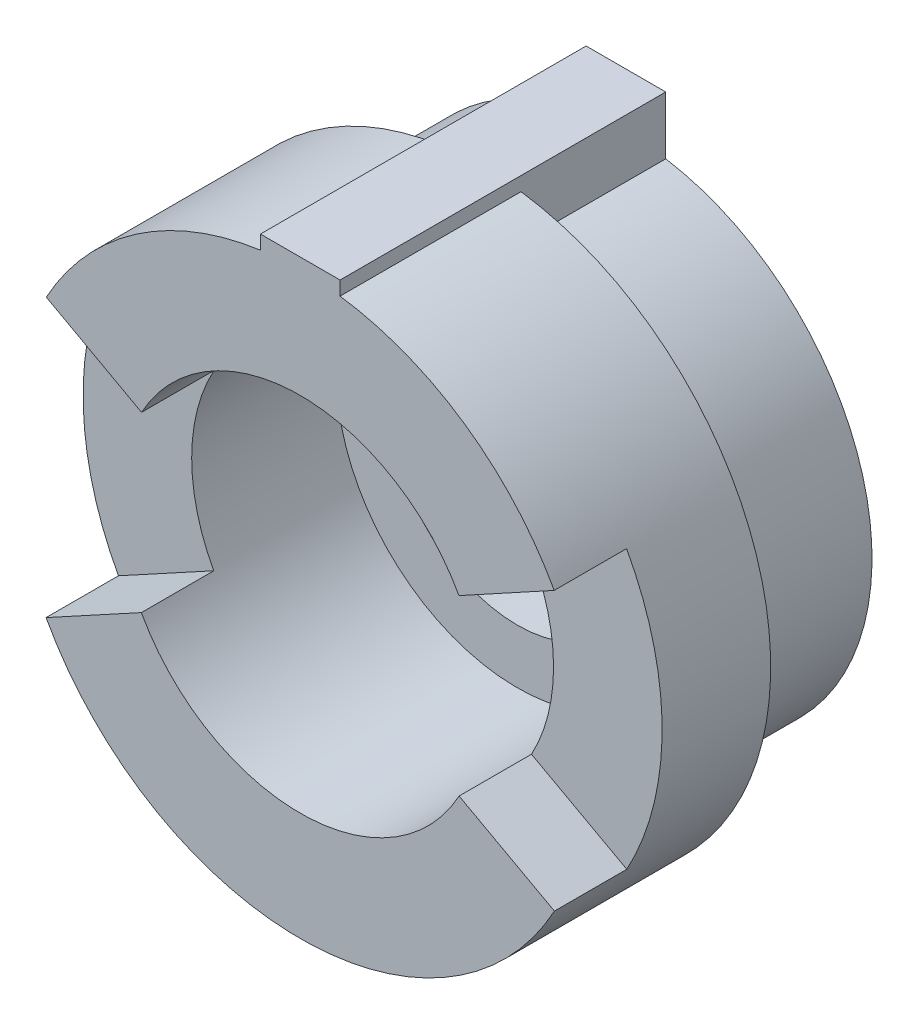
ISO-10303-21;
HEADER;
FILE_DESCRIPTION(('STEP AP214'),'2;1');
FILE_NAME('part.step','',(''),(''),'','','');
FILE_SCHEMA(('AUTOMOTIVE_DESIGN { 1 0 10303 214 1 1 1 1 }'));
ENDSEC;
DATA;
#1=APPLICATION_CONTEXT('core data for automotive mechanical design processes');
#2=APPLICATION_PROTOCOL_DEFINITION('international standard','automotive_design',2000,#1);
#3=PRODUCT_CONTEXT('',#1,'mechanical');
#4=PRODUCT('Part','Part','',(#3));
#5=PRODUCT_RELATED_PRODUCT_CATEGORY('part','',(#4));
#6=PRODUCT_DEFINITION_FORMATION('','',#4);
#7=PRODUCT_DEFINITION_CONTEXT('part definition',#1,'design');
#8=PRODUCT_DEFINITION('design','',#6,#7);
#9=PRODUCT_DEFINITION_SHAPE('','',#8);
#10=(LENGTH_UNIT() NAMED_UNIT(*) SI_UNIT(.MILLI.,.METRE.));
#11=(NAMED_UNIT(*) PLANE_ANGLE_UNIT() SI_UNIT($,.RADIAN.));
#12=(NAMED_UNIT(*) SI_UNIT($,.STERADIAN.) SOLID_ANGLE_UNIT());
#13=UNCERTAINTY_MEASURE_WITH_UNIT(LENGTH_MEASURE(1.E-05),#10,'distance_accuracy_value','');
#14=(GEOMETRIC_REPRESENTATION_CONTEXT(3) GLOBAL_UNCERTAINTY_ASSIGNED_CONTEXT((#13)) GLOBAL_UNIT_ASSIGNED_CONTEXT((#10,
#11,#12)) REPRESENTATION_CONTEXT('',''));
#15=CARTESIAN_POINT('',(0.,0.,0.));
#16=DIRECTION('',(0.,0.,1.));
#17=DIRECTION('',(1.,0.,0.));
#18=AXIS2_PLACEMENT_3D('',#15,#16,#17);
#19=CARTESIAN_POINT('',(0.,0.,9.));
#20=DIRECTION('',(0.,0.,1.));
#21=DIRECTION('',(1.,0.,0.));
#22=AXIS2_PLACEMENT_3D('',#19,#20,#21);
#23=PLANE('',#22);
#24=DIRECTION('',(0.,1.,0.));
#25=VECTOR('',#24,1.);
#26=CARTESIAN_POINT('',(-1.10000000000002,8.31043962792305,9.));
#27=LINE('',#26,#25);
#28=CARTESIAN_POINT('',(-1.10000000000002,7.92401413426301,9.));
#29=VERTEX_POINT('',#28);
#30=CARTESIAN_POINT('',(-1.10000000000002,8.31043962792305,9.));
#31=VERTEX_POINT('',#30);
#32=EDGE_CURVE('E181',#29,#31,#27,.T.);
#33=ORIENTED_EDGE('',*,*,#32,.F.);
#34=CARTESIAN_POINT('',(0.,0.,9.));
#35=DIRECTION('',(0.,0.,1.));
#36=DIRECTION('',(1.,0.,0.));
#37=AXIS2_PLACEMENT_3D('',#34,#35,#36);
#38=CIRCLE('',#37,8.);
#39=CARTESIAN_POINT('',(-7.01760403419745,3.84099383222828,9.));
#40=VERTEX_POINT('',#39);
#41=EDGE_CURVE('E84',#29,#40,#38,.T.);
#42=ORIENTED_EDGE('',*,*,#41,.T.);
#43=DIRECTION('',(-0.877200504274681,0.480124229028535,0.));
#44=VECTOR('',#43,1.);
#45=CARTESIAN_POINT('',(-7.01760403419745,3.84099383222828,9.));
#46=LINE('',#45,#44);
#47=CARTESIAN_POINT('',(-4.38600252137341,2.40062114514268,9.));
#48=VERTEX_POINT('',#47);
#49=EDGE_CURVE('E234',#48,#40,#46,.T.);
#50=ORIENTED_EDGE('',*,*,#49,.F.);
#51=CARTESIAN_POINT('',(0.,0.,9.));
#52=DIRECTION('',(0.,0.,1.));
#53=DIRECTION('',(1.,0.,0.));
#54=AXIS2_PLACEMENT_3D('',#51,#52,#53);
#55=CIRCLE('',#54,5.);
#56=CARTESIAN_POINT('',(4.38600252137341,2.40062114514267,9.));
#57=VERTEX_POINT('',#56);
#58=EDGE_CURVE('E259',#57,#48,#55,.T.);
#59=ORIENTED_EDGE('',*,*,#58,.F.);
#60=DIRECTION('',(0.877200504274682,0.480124229028534,0.));
#61=VECTOR('',#60,1.);
#62=CARTESIAN_POINT('',(7.01760403419745,3.84099383222827,9.));
#63=LINE('',#62,#61);
#64=CARTESIAN_POINT('',(7.01760403419745,3.84099383222827,9.));
#65=VERTEX_POINT('',#64);
#66=EDGE_CURVE('E255',#57,#65,#63,.T.);
#67=ORIENTED_EDGE('',*,*,#66,.T.);
#68=CARTESIAN_POINT('',(1.09999999999999,7.92401413426301,9.));
#69=VERTEX_POINT('',#68);
#70=EDGE_CURVE('E188',#65,#69,#38,.T.);
#71=ORIENTED_EDGE('',*,*,#70,.T.);
#72=DIRECTION('',(0.,-1.,0.));
#73=VECTOR('',#72,1.);
#74=CARTESIAN_POINT('',(1.09999999999999,7.73115928508523,9.));
#75=LINE('',#74,#73);
#76=CARTESIAN_POINT('',(1.09999999999999,8.31043962792305,9.));
#77=VERTEX_POINT('',#76);
#78=EDGE_CURVE('E173',#77,#69,#75,.T.);
#79=ORIENTED_EDGE('',*,*,#78,.F.);
#80=DIRECTION('',(1.,0.,0.));
#81=VECTOR('',#80,1.);
#82=CARTESIAN_POINT('',(1.09999999999999,8.31043962792305,9.));
#83=LINE('',#82,#81);
#84=EDGE_CURVE('E186',#31,#77,#83,.T.);
#85=ORIENTED_EDGE('',*,*,#84,.F.);
#86=EDGE_LOOP('',(#33,#42,#50,#59,#67,#71,#79,#85));
#87=FACE_BOUND('',#86,.T.);
#88=ADVANCED_FACE('F69',(#87),#23,.T.);
#89=CARTESIAN_POINT('',(0.,0.,3.));
#90=DIRECTION('',(0.,0.,1.));
#91=DIRECTION('',(1.,0.,0.));
#92=AXIS2_PLACEMENT_3D('',#89,#90,#91);
#93=PLANE('',#92);
#94=CARTESIAN_POINT('',(0.,0.,3.));
#95=DIRECTION('',(0.,0.,1.));
#96=DIRECTION('',(1.,0.,0.));
#97=AXIS2_PLACEMENT_3D('',#94,#95,#96);
#98=CIRCLE('',#97,5.);
#99=CARTESIAN_POINT('',(5.,0.,3.));
#100=VERTEX_POINT('',#99);
#101=EDGE_CURVE('E268',#100,#100,#98,.F.);
#102=ORIENTED_EDGE('',*,*,#101,.F.);
#103=EDGE_LOOP('',(#102));
#104=FACE_BOUND('',#103,.T.);
#105=CARTESIAN_POINT('',(0.,0.,3.));
#106=DIRECTION('',(0.,0.,1.));
#107=DIRECTION('',(1.,0.,0.));
#108=AXIS2_PLACEMENT_3D('',#105,#106,#107);
#109=CIRCLE('',#108,3.5);
#110=CARTESIAN_POINT('',(3.5,0.,3.));
#111=VERTEX_POINT('',#110);
#112=EDGE_CURVE('E265',#111,#111,#109,.T.);
#113=ORIENTED_EDGE('',*,*,#112,.F.);
#114=EDGE_LOOP('',(#113));
#115=FACE_BOUND('',#114,.T.);
#116=ADVANCED_FACE('F329',(#104,#115),#93,.T.);
#117=CARTESIAN_POINT('',(0.,0.,0.));
#118=DIRECTION('',(0.,0.,1.));
#119=DIRECTION('',(1.,0.,0.));
#120=AXIS2_PLACEMENT_3D('',#117,#118,#119);
#121=PLANE('',#120);
#122=CARTESIAN_POINT('',(0.,0.,0.));
#123=DIRECTION('',(0.,0.,1.));
#124=DIRECTION('',(-1.,0.,0.));
#125=AXIS2_PLACEMENT_3D('',#122,#123,#124);
#126=CIRCLE('',#125,6.8);
#127=CARTESIAN_POINT('',(-1.1,6.71043962792305,0.));
#128=VERTEX_POINT('',#127);
#129=CARTESIAN_POINT('',(1.09999999999999,6.71043962792305,0.));
#130=VERTEX_POINT('',#129);
#131=EDGE_CURVE('E215',#128,#130,#126,.T.);
#132=ORIENTED_EDGE('',*,*,#131,.F.);
#133=DIRECTION('',(0.,-1.,0.));
#134=VECTOR('',#133,1.);
#135=CARTESIAN_POINT('',(-1.1,7.92401413426301,0.));
#136=LINE('',#135,#134);
#137=CARTESIAN_POINT('',(-1.10000000000002,8.31043962792305,0.));
#138=VERTEX_POINT('',#137);
#139=EDGE_CURVE('E202',#138,#128,#136,.T.);
#140=ORIENTED_EDGE('',*,*,#139,.F.);
#141=DIRECTION('',(1.,0.,0.));
#142=VECTOR('',#141,1.);
#143=CARTESIAN_POINT('',(1.09999999999999,8.31043962792305,0.));
#144=LINE('',#143,#142);
#145=CARTESIAN_POINT('',(1.09999999999999,8.31043962792305,0.));
#146=VERTEX_POINT('',#145);
#147=EDGE_CURVE('E193',#138,#146,#144,.T.);
#148=ORIENTED_EDGE('',*,*,#147,.T.);
#149=DIRECTION('',(0.,1.,0.));
#150=VECTOR('',#149,1.);
#151=CARTESIAN_POINT('',(1.09999999999999,6.71043962792305,0.));
#152=LINE('',#151,#150);
#153=EDGE_CURVE('E175',#130,#146,#152,.T.);
#154=ORIENTED_EDGE('',*,*,#153,.F.);
#155=EDGE_LOOP('',(#132,#140,#148,#154));
#156=FACE_BOUND('',#155,.T.);
#157=CARTESIAN_POINT('',(0.,0.,0.));
#158=DIRECTION('',(0.,0.,1.));
#159=DIRECTION('',(1.,0.,0.));
#160=AXIS2_PLACEMENT_3D('',#157,#158,#159);
#161=CIRCLE('',#160,3.5);
#162=CARTESIAN_POINT('',(3.5,0.,0.));
#163=VERTEX_POINT('',#162);
#164=EDGE_CURVE('E264',#163,#163,#161,.T.);
#165=ORIENTED_EDGE('',*,*,#164,.T.);
#166=EDGE_LOOP('',(#165));
#167=FACE_BOUND('',#166,.T.);
#168=ADVANCED_FACE('F336',(#156,#167),#121,.F.);
#169=CARTESIAN_POINT('',(0.,0.,3.));
#170=DIRECTION('',(0.,0.,-1.));
#171=DIRECTION('',(-1.,0.,0.));
#172=AXIS2_PLACEMENT_3D('',#169,#170,#171);
#173=CYLINDRICAL_SURFACE('',#172,8.);
#174=ORIENTED_EDGE('',*,*,#41,.F.);
#175=DIRECTION('',(0.,0.,-1.));
#176=VECTOR('',#175,1.);
#177=CARTESIAN_POINT('',(-1.10000000000002,7.92401413426301,3.));
#178=LINE('',#177,#176);
#179=CARTESIAN_POINT('',(-1.1,7.92401413426301,4.));
#180=VERTEX_POINT('',#179);
#181=EDGE_CURVE('E200',#29,#180,#178,.T.);
#182=ORIENTED_EDGE('',*,*,#181,.T.);
#183=CARTESIAN_POINT('',(0.,0.,4.));
#184=DIRECTION('',(0.,0.,-1.));
#185=DIRECTION('',(-1.,0.,0.));
#186=AXIS2_PLACEMENT_3D('',#183,#184,#185);
#187=CIRCLE('',#186,8.);
#188=CARTESIAN_POINT('',(1.09999999999999,7.92401413426301,4.));
#189=VERTEX_POINT('',#188);
#190=EDGE_CURVE('E203',#189,#180,#187,.T.);
#191=ORIENTED_EDGE('',*,*,#190,.F.);
#192=DIRECTION('',(0.,0.,-1.));
#193=VECTOR('',#192,1.);
#194=CARTESIAN_POINT('',(1.09999999999999,7.92401413426301,3.));
#195=LINE('',#194,#193);
#196=EDGE_CURVE('E91',#189,#69,#195,.F.);
#197=ORIENTED_EDGE('',*,*,#196,.T.);
#198=ORIENTED_EDGE('',*,*,#70,.F.);
#199=DIRECTION('',(0.,0.,1.));
#200=VECTOR('',#199,1.);
#201=CARTESIAN_POINT('',(7.01760403419745,3.84099383222827,7.));
#202=LINE('',#201,#200);
#203=CARTESIAN_POINT('',(7.01760403419745,3.84099383222827,7.));
#204=VERTEX_POINT('',#203);
#205=EDGE_CURVE('E244',#204,#65,#202,.T.);
#206=ORIENTED_EDGE('',*,*,#205,.F.);
#207=CARTESIAN_POINT('',(0.,0.,7.));
#208=DIRECTION('',(0.,0.,-1.));
#209=DIRECTION('',(0.877964062999077,-0.478726544158722,0.));
#210=AXIS2_PLACEMENT_3D('',#207,#208,#209);
#211=CIRCLE('',#210,8.);
#212=CARTESIAN_POINT('',(7.02371250399262,-3.82981235326977,7.));
#213=VERTEX_POINT('',#212);
#214=EDGE_CURVE('E240',#204,#213,#211,.T.);
#215=ORIENTED_EDGE('',*,*,#214,.T.);
#216=DIRECTION('',(0.,0.,-1.));
#217=VECTOR('',#216,1.);
#218=CARTESIAN_POINT('',(7.02371250399262,-3.82981235326977,9.));
#219=LINE('',#218,#217);
#220=CARTESIAN_POINT('',(7.02371250399262,-3.82981235326977,9.));
#221=VERTEX_POINT('',#220);
#222=EDGE_CURVE('E246',#221,#213,#219,.T.);
#223=ORIENTED_EDGE('',*,*,#222,.F.);
#224=CARTESIAN_POINT('',(-7.02371250399263,-3.82981235326976,9.));
#225=VERTEX_POINT('',#224);
#226=EDGE_CURVE('E262',#225,#221,#38,.T.);
#227=ORIENTED_EDGE('',*,*,#226,.F.);
#228=DIRECTION('',(0.,0.,1.));
#229=VECTOR('',#228,1.);
#230=CARTESIAN_POINT('',(-7.02371250399263,-3.82981235326976,7.));
#231=LINE('',#230,#229);
#232=CARTESIAN_POINT('',(-7.02371250399263,-3.82981235326976,7.));
#233=VERTEX_POINT('',#232);
#234=EDGE_CURVE('E226',#233,#225,#231,.T.);
#235=ORIENTED_EDGE('',*,*,#234,.F.);
#236=CARTESIAN_POINT('',(0.,0.,7.));
#237=DIRECTION('',(0.,0.,-1.));
#238=DIRECTION('',(-0.877200504274681,0.480124229028534,0.));
#239=AXIS2_PLACEMENT_3D('',#236,#237,#238);
#240=CIRCLE('',#239,8.);
#241=CARTESIAN_POINT('',(-7.01760403419745,3.84099383222828,7.));
#242=VERTEX_POINT('',#241);
#243=EDGE_CURVE('E221',#233,#242,#240,.T.);
#244=ORIENTED_EDGE('',*,*,#243,.T.);
#245=DIRECTION('',(0.,0.,-1.));
#246=VECTOR('',#245,1.);
#247=CARTESIAN_POINT('',(-7.01760403419745,3.84099383222828,9.));
#248=LINE('',#247,#246);
#249=EDGE_CURVE('E228',#40,#242,#248,.T.);
#250=ORIENTED_EDGE('',*,*,#249,.F.);
#251=EDGE_LOOP('',(#174,#182,#191,#197,#198,#206,#215,#223,#227,#235,#244,#250));
#252=FACE_BOUND('',#251,.T.);
#253=ADVANCED_FACE('F71',(#252),#173,.T.);
#254=CARTESIAN_POINT('',(0.,0.,3.));
#255=DIRECTION('',(0.,0.,-1.));
#256=DIRECTION('',(-1.,0.,0.));
#257=AXIS2_PLACEMENT_3D('',#254,#255,#256);
#258=CYLINDRICAL_SURFACE('',#257,3.5);
#259=ORIENTED_EDGE('',*,*,#112,.T.);
#260=EDGE_LOOP('',(#259));
#261=FACE_BOUND('',#260,.T.);
#262=ORIENTED_EDGE('',*,*,#164,.F.);
#263=EDGE_LOOP('',(#262));
#264=FACE_BOUND('',#263,.T.);
#265=ADVANCED_FACE('F341',(#261,#264),#258,.F.);
#266=DIRECTION('',(-0.877964062999078,-0.47872654415872,0.));
#267=VECTOR('',#266,1.);
#268=CARTESIAN_POINT('',(-7.02371250399263,-3.82981235326976,9.));
#269=LINE('',#268,#267);
#270=CARTESIAN_POINT('',(-4.38982031499539,-2.3936327207936,9.));
#271=VERTEX_POINT('',#270);
#272=EDGE_CURVE('E237',#271,#225,#269,.T.);
#273=ORIENTED_EDGE('',*,*,#272,.T.);
#274=ORIENTED_EDGE('',*,*,#226,.T.);
#275=DIRECTION('',(0.877964062999077,-0.478726544158722,0.));
#276=VECTOR('',#275,1.);
#277=CARTESIAN_POINT('',(7.02371250399262,-3.82981235326977,9.));
#278=LINE('',#277,#276);
#279=CARTESIAN_POINT('',(4.38982031499539,-2.39363272079361,9.));
#280=VERTEX_POINT('',#279);
#281=EDGE_CURVE('E252',#280,#221,#278,.T.);
#282=ORIENTED_EDGE('',*,*,#281,.F.);
#283=EDGE_CURVE('E257',#271,#280,#55,.T.);
#284=ORIENTED_EDGE('',*,*,#283,.F.);
#285=EDGE_LOOP('',(#273,#274,#282,#284));
#286=FACE_BOUND('',#285,.T.);
#287=ADVANCED_FACE('F305',(#286),#23,.T.);
#288=CARTESIAN_POINT('',(0.,0.,9.));
#289=DIRECTION('',(0.,0.,-1.));
#290=DIRECTION('',(-1.,0.,0.));
#291=AXIS2_PLACEMENT_3D('',#288,#289,#290);
#292=CYLINDRICAL_SURFACE('',#291,5.);
#293=DIRECTION('',(0.,0.,-1.));
#294=VECTOR('',#293,1.);
#295=CARTESIAN_POINT('',(-4.38600252137341,2.40062114514268,9.));
#296=LINE('',#295,#294);
#297=CARTESIAN_POINT('',(-4.38600252137341,2.40062114514268,7.));
#298=VERTEX_POINT('',#297);
#299=EDGE_CURVE('E13',#298,#48,#296,.F.);
#300=ORIENTED_EDGE('',*,*,#299,.F.);
#301=CARTESIAN_POINT('',(0.,0.,7.));
#302=DIRECTION('',(0.,0.,1.));
#303=DIRECTION('',(1.,0.,0.));
#304=AXIS2_PLACEMENT_3D('',#301,#302,#303);
#305=CIRCLE('',#304,5.);
#306=CARTESIAN_POINT('',(-4.38982031499539,-2.3936327207936,7.));
#307=VERTEX_POINT('',#306);
#308=EDGE_CURVE('E77',#307,#298,#305,.F.);
#309=ORIENTED_EDGE('',*,*,#308,.F.);
#310=DIRECTION('',(0.,0.,-1.));
#311=VECTOR('',#310,1.);
#312=CARTESIAN_POINT('',(-4.38982031499539,-2.3936327207936,9.));
#313=LINE('',#312,#311);
#314=EDGE_CURVE('E280',#271,#307,#313,.T.);
#315=ORIENTED_EDGE('',*,*,#314,.F.);
#316=ORIENTED_EDGE('',*,*,#283,.T.);
#317=DIRECTION('',(0.,0.,-1.));
#318=VECTOR('',#317,1.);
#319=CARTESIAN_POINT('',(4.38982031499539,-2.39363272079361,9.));
#320=LINE('',#319,#318);
#321=CARTESIAN_POINT('',(4.38982031499539,-2.39363272079361,7.));
#322=VERTEX_POINT('',#321);
#323=EDGE_CURVE('E277',#322,#280,#320,.F.);
#324=ORIENTED_EDGE('',*,*,#323,.F.);
#325=CARTESIAN_POINT('',(0.,0.,7.));
#326=DIRECTION('',(0.,0.,1.));
#327=DIRECTION('',(1.,0.,0.));
#328=AXIS2_PLACEMENT_3D('',#325,#326,#327);
#329=CIRCLE('',#328,5.);
#330=CARTESIAN_POINT('',(4.38600252137341,2.40062114514267,7.));
#331=VERTEX_POINT('',#330);
#332=EDGE_CURVE('E275',#331,#322,#329,.F.);
#333=ORIENTED_EDGE('',*,*,#332,.F.);
#334=DIRECTION('',(0.,0.,-1.));
#335=VECTOR('',#334,1.);
#336=CARTESIAN_POINT('',(4.38600252137341,2.40062114514267,9.));
#337=LINE('',#336,#335);
#338=EDGE_CURVE('E273',#57,#331,#337,.T.);
#339=ORIENTED_EDGE('',*,*,#338,.F.);
#340=ORIENTED_EDGE('',*,*,#58,.T.);
#341=EDGE_LOOP('',(#300,#309,#315,#316,#324,#333,#339,#340));
#342=FACE_BOUND('',#341,.T.);
#343=ORIENTED_EDGE('',*,*,#101,.T.);
#344=EDGE_LOOP('',(#343));
#345=FACE_BOUND('',#344,.T.);
#346=ADVANCED_FACE('F293',(#342,#345),#292,.F.);
#347=CARTESIAN_POINT('',(7.02371250399262,-3.82981235326977,8.));
#348=DIRECTION('',(-0.478726544158722,-0.877964062999077,0.));
#349=DIRECTION('',(0.,0.,-1.));
#350=AXIS2_PLACEMENT_3D('',#347,#348,#349);
#351=PLANE('',#350);
#352=ORIENTED_EDGE('',*,*,#323,.T.);
#353=ORIENTED_EDGE('',*,*,#281,.T.);
#354=ORIENTED_EDGE('',*,*,#222,.T.);
#355=DIRECTION('',(0.877964062999077,-0.478726544158722,0.));
#356=VECTOR('',#355,1.);
#357=CARTESIAN_POINT('',(7.02371250399262,-3.82981235326977,7.));
#358=LINE('',#357,#356);
#359=EDGE_CURVE('E250',#322,#213,#358,.T.);
#360=ORIENTED_EDGE('',*,*,#359,.F.);
#361=EDGE_LOOP('',(#352,#353,#354,#360));
#362=FACE_BOUND('',#361,.T.);
#363=ADVANCED_FACE('F310',(#362),#351,.F.);
#364=CARTESIAN_POINT('',(0.,0.,7.));
#365=DIRECTION('',(0.,0.,1.));
#366=DIRECTION('',(1.,0.,0.));
#367=AXIS2_PLACEMENT_3D('',#364,#365,#366);
#368=PLANE('',#367);
#369=ORIENTED_EDGE('',*,*,#332,.T.);
#370=ORIENTED_EDGE('',*,*,#359,.T.);
#371=ORIENTED_EDGE('',*,*,#214,.F.);
#372=DIRECTION('',(0.877200504274682,0.480124229028534,0.));
#373=VECTOR('',#372,1.);
#374=CARTESIAN_POINT('',(7.01760403419745,3.84099383222827,7.));
#375=LINE('',#374,#373);
#376=EDGE_CURVE('E249',#331,#204,#375,.T.);
#377=ORIENTED_EDGE('',*,*,#376,.F.);
#378=EDGE_LOOP('',(#369,#370,#371,#377));
#379=FACE_BOUND('',#378,.T.);
#380=ADVANCED_FACE('F313',(#379),#368,.T.);
#381=CARTESIAN_POINT('',(7.01760403419745,3.84099383222827,8.));
#382=DIRECTION('',(-0.480124229028534,0.877200504274682,0.));
#383=DIRECTION('',(0.,0.,1.));
#384=AXIS2_PLACEMENT_3D('',#381,#382,#383);
#385=PLANE('',#384);
#386=ORIENTED_EDGE('',*,*,#338,.T.);
#387=ORIENTED_EDGE('',*,*,#376,.T.);
#388=ORIENTED_EDGE('',*,*,#205,.T.);
#389=ORIENTED_EDGE('',*,*,#66,.F.);
#390=EDGE_LOOP('',(#386,#387,#388,#389));
#391=FACE_BOUND('',#390,.T.);
#392=ADVANCED_FACE('F317',(#391),#385,.F.);
#393=CARTESIAN_POINT('',(-7.01760403419745,3.84099383222828,8.));
#394=DIRECTION('',(0.480124229028535,0.877200504274681,0.));
#395=DIRECTION('',(0.,0.,-1.));
#396=AXIS2_PLACEMENT_3D('',#393,#394,#395);
#397=PLANE('',#396);
#398=ORIENTED_EDGE('',*,*,#299,.T.);
#399=ORIENTED_EDGE('',*,*,#49,.T.);
#400=ORIENTED_EDGE('',*,*,#249,.T.);
#401=DIRECTION('',(-0.877200504274681,0.480124229028535,0.));
#402=VECTOR('',#401,1.);
#403=CARTESIAN_POINT('',(-7.01760403419745,3.84099383222828,7.));
#404=LINE('',#403,#402);
#405=EDGE_CURVE('E232',#298,#242,#404,.T.);
#406=ORIENTED_EDGE('',*,*,#405,.F.);
#407=EDGE_LOOP('',(#398,#399,#400,#406));
#408=FACE_BOUND('',#407,.T.);
#409=ADVANCED_FACE('F291',(#408),#397,.F.);
#410=CARTESIAN_POINT('',(0.,0.,7.));
#411=DIRECTION('',(0.,0.,1.));
#412=DIRECTION('',(1.,0.,0.));
#413=AXIS2_PLACEMENT_3D('',#410,#411,#412);
#414=PLANE('',#413);
#415=ORIENTED_EDGE('',*,*,#308,.T.);
#416=ORIENTED_EDGE('',*,*,#405,.T.);
#417=ORIENTED_EDGE('',*,*,#243,.F.);
#418=DIRECTION('',(-0.877964062999078,-0.47872654415872,0.));
#419=VECTOR('',#418,1.);
#420=CARTESIAN_POINT('',(-7.02371250399263,-3.82981235326976,7.));
#421=LINE('',#420,#419);
#422=EDGE_CURVE('E231',#307,#233,#421,.T.);
#423=ORIENTED_EDGE('',*,*,#422,.F.);
#424=EDGE_LOOP('',(#415,#416,#417,#423));
#425=FACE_BOUND('',#424,.T.);
#426=ADVANCED_FACE('F285',(#425),#414,.T.);
#427=CARTESIAN_POINT('',(-7.02371250399263,-3.82981235326976,8.));
#428=DIRECTION('',(0.47872654415872,-0.877964062999078,0.));
#429=DIRECTION('',(0.,0.,1.));
#430=AXIS2_PLACEMENT_3D('',#427,#428,#429);
#431=PLANE('',#430);
#432=ORIENTED_EDGE('',*,*,#314,.T.);
#433=ORIENTED_EDGE('',*,*,#422,.T.);
#434=ORIENTED_EDGE('',*,*,#234,.T.);
#435=ORIENTED_EDGE('',*,*,#272,.F.);
#436=EDGE_LOOP('',(#432,#433,#434,#435));
#437=FACE_BOUND('',#436,.T.);
#438=ADVANCED_FACE('F302',(#437),#431,.F.);
#439=CARTESIAN_POINT('',(1.09999999999999,6.71043962792305,4.));
#440=DIRECTION('',(-1.,0.,0.));
#441=DIRECTION('',(0.,-1.,0.));
#442=AXIS2_PLACEMENT_3D('',#439,#440,#441);
#443=PLANE('',#442);
#444=ORIENTED_EDGE('',*,*,#153,.T.);
#445=DIRECTION('',(0.,0.,-1.));
#446=VECTOR('',#445,1.);
#447=CARTESIAN_POINT('',(1.09999999999999,8.31043962792305,9.));
#448=LINE('',#447,#446);
#449=EDGE_CURVE('E170',#77,#146,#448,.T.);
#450=ORIENTED_EDGE('',*,*,#449,.F.);
#451=ORIENTED_EDGE('',*,*,#78,.T.);
#452=ORIENTED_EDGE('',*,*,#196,.F.);
#453=DIRECTION('',(0.,1.,0.));
#454=VECTOR('',#453,1.);
#455=CARTESIAN_POINT('',(1.09999999999999,6.71043962792305,4.));
#456=LINE('',#455,#454);
#457=CARTESIAN_POINT('',(1.09999999999999,6.71043962792305,4.));
#458=VERTEX_POINT('',#457);
#459=EDGE_CURVE('E211',#458,#189,#456,.T.);
#460=ORIENTED_EDGE('',*,*,#459,.F.);
#461=DIRECTION('',(0.,0.,-1.));
#462=VECTOR('',#461,1.);
#463=CARTESIAN_POINT('',(1.09999999999999,6.71043962792305,4.));
#464=LINE('',#463,#462);
#465=EDGE_CURVE('E219',#458,#130,#464,.T.);
#466=ORIENTED_EDGE('',*,*,#465,.T.);
#467=EDGE_LOOP('',(#444,#450,#451,#452,#460,#466));
#468=FACE_BOUND('',#467,.T.);
#469=ADVANCED_FACE('F172',(#468),#443,.F.);
#470=CARTESIAN_POINT('',(0.,0.,4.));
#471=DIRECTION('',(0.,0.,-1.));
#472=DIRECTION('',(-1.,0.,0.));
#473=AXIS2_PLACEMENT_3D('',#470,#471,#472);
#474=CYLINDRICAL_SURFACE('',#473,6.8);
#475=ORIENTED_EDGE('',*,*,#131,.T.);
#476=ORIENTED_EDGE('',*,*,#465,.F.);
#477=CARTESIAN_POINT('',(0.,0.,4.));
#478=DIRECTION('',(0.,0.,1.));
#479=DIRECTION('',(-1.,0.,0.));
#480=AXIS2_PLACEMENT_3D('',#477,#478,#479);
#481=CIRCLE('',#480,6.8);
#482=CARTESIAN_POINT('',(-1.1,6.71043962792305,4.));
#483=VERTEX_POINT('',#482);
#484=EDGE_CURVE('E208',#483,#458,#481,.T.);
#485=ORIENTED_EDGE('',*,*,#484,.F.);
#486=DIRECTION('',(0.,0.,-1.));
#487=VECTOR('',#486,1.);
#488=CARTESIAN_POINT('',(-1.1,6.71043962792305,4.));
#489=LINE('',#488,#487);
#490=EDGE_CURVE('E213',#483,#128,#489,.T.);
#491=ORIENTED_EDGE('',*,*,#490,.T.);
#492=EDGE_LOOP('',(#475,#476,#485,#491));
#493=FACE_BOUND('',#492,.T.);
#494=ADVANCED_FACE('F360',(#493),#474,.T.);
#495=CARTESIAN_POINT('',(-1.1,7.92401413426301,4.));
#496=DIRECTION('',(1.,0.,0.));
#497=DIRECTION('',(0.,0.,-1.));
#498=AXIS2_PLACEMENT_3D('',#495,#496,#497);
#499=PLANE('',#498);
#500=ORIENTED_EDGE('',*,*,#490,.F.);
#501=DIRECTION('',(0.,-1.,0.));
#502=VECTOR('',#501,1.);
#503=CARTESIAN_POINT('',(-1.1,7.92401413426301,4.));
#504=LINE('',#503,#502);
#505=EDGE_CURVE('E206',#180,#483,#504,.T.);
#506=ORIENTED_EDGE('',*,*,#505,.F.);
#507=ORIENTED_EDGE('',*,*,#181,.F.);
#508=ORIENTED_EDGE('',*,*,#32,.T.);
#509=DIRECTION('',(0.,0.,-1.));
#510=VECTOR('',#509,1.);
#511=CARTESIAN_POINT('',(-1.10000000000002,8.31043962792305,9.));
#512=LINE('',#511,#510);
#513=EDGE_CURVE('E180',#31,#138,#512,.T.);
#514=ORIENTED_EDGE('',*,*,#513,.T.);
#515=ORIENTED_EDGE('',*,*,#139,.T.);
#516=EDGE_LOOP('',(#500,#506,#507,#508,#514,#515));
#517=FACE_BOUND('',#516,.T.);
#518=ADVANCED_FACE('F365',(#517),#499,.F.);
#519=CARTESIAN_POINT('',(0.,0.,4.));
#520=DIRECTION('',(0.,0.,-1.));
#521=DIRECTION('',(-1.,0.,0.));
#522=AXIS2_PLACEMENT_3D('',#519,#520,#521);
#523=PLANE('',#522);
#524=ORIENTED_EDGE('',*,*,#190,.T.);
#525=ORIENTED_EDGE('',*,*,#505,.T.);
#526=ORIENTED_EDGE('',*,*,#484,.T.);
#527=ORIENTED_EDGE('',*,*,#459,.T.);
#528=EDGE_LOOP('',(#524,#525,#526,#527));
#529=FACE_BOUND('',#528,.T.);
#530=ADVANCED_FACE('F368',(#529),#523,.T.);
#531=CARTESIAN_POINT('',(1.09999999999999,8.31043962792305,9.));
#532=DIRECTION('',(0.,1.,0.));
#533=DIRECTION('',(0.,0.,1.));
#534=AXIS2_PLACEMENT_3D('',#531,#532,#533);
#535=PLANE('',#534);
#536=ORIENTED_EDGE('',*,*,#147,.F.);
#537=ORIENTED_EDGE('',*,*,#513,.F.);
#538=ORIENTED_EDGE('',*,*,#84,.T.);
#539=ORIENTED_EDGE('',*,*,#449,.T.);
#540=EDGE_LOOP('',(#536,#537,#538,#539));
#541=FACE_BOUND('',#540,.T.);
#542=ADVANCED_FACE('F191',(#541),#535,.T.);
#543=CLOSED_SHELL('',(#88,#116,#168,#253,#265,#287,#346,#363,#380,#392,#409,#426,#438,#469,#494,
#518,#530,#542));
#544=MANIFOLD_SOLID_BREP('B2',#543);
#545=ADVANCED_BREP_SHAPE_REPRESENTATION('',(#18,#544),#14);
#546=SHAPE_DEFINITION_REPRESENTATION(#9,#545);
ENDSEC;
END-ISO-10303-21;
